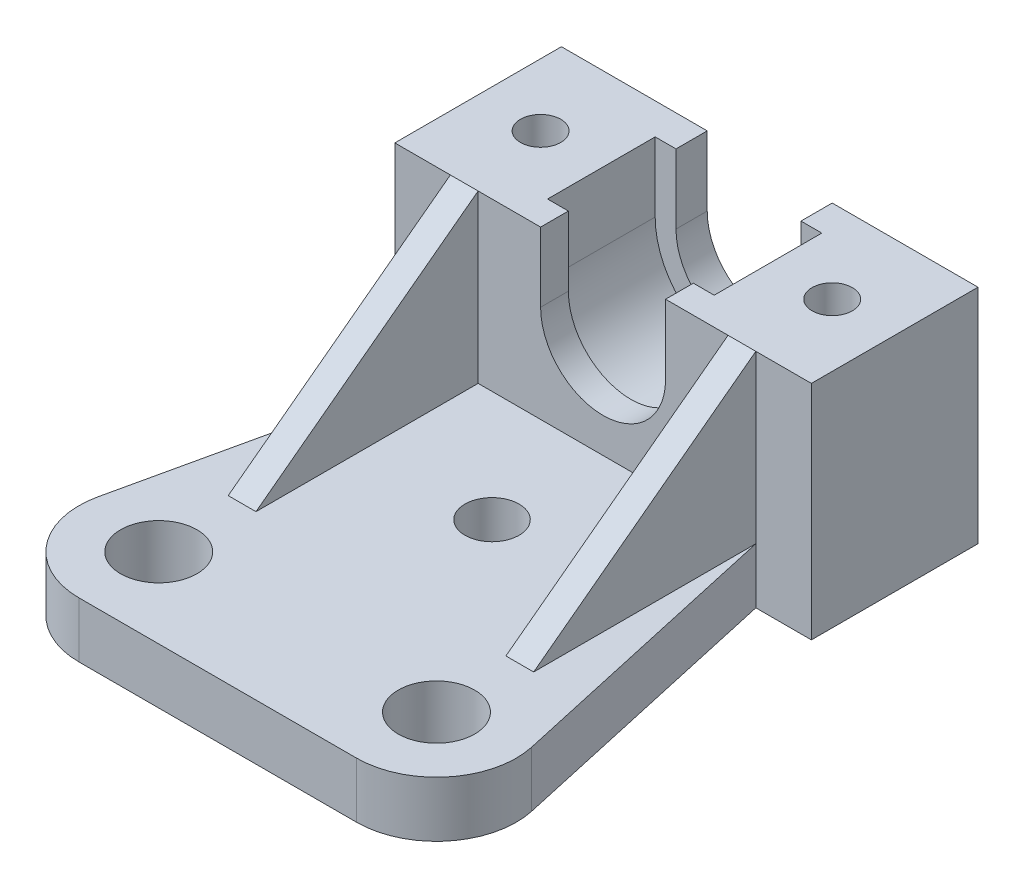
ISO-10303-21;
HEADER;
FILE_DESCRIPTION(('STEP AP214'),'2;1');
FILE_NAME('part.step','',(''),(''),'','','');
FILE_SCHEMA(('AUTOMOTIVE_DESIGN { 1 0 10303 214 1 1 1 1 }'));
ENDSEC;
DATA;
#1=APPLICATION_CONTEXT('core data for automotive mechanical design processes');
#2=APPLICATION_PROTOCOL_DEFINITION('international standard','automotive_design',2000,#1);
#3=PRODUCT_CONTEXT('',#1,'mechanical');
#4=PRODUCT('Part','Part','',(#3));
#5=PRODUCT_RELATED_PRODUCT_CATEGORY('part','',(#4));
#6=PRODUCT_DEFINITION_FORMATION('','',#4);
#7=PRODUCT_DEFINITION_CONTEXT('part definition',#1,'design');
#8=PRODUCT_DEFINITION('design','',#6,#7);
#9=PRODUCT_DEFINITION_SHAPE('','',#8);
#10=(LENGTH_UNIT() NAMED_UNIT(*) SI_UNIT(.MILLI.,.METRE.));
#11=(NAMED_UNIT(*) PLANE_ANGLE_UNIT() SI_UNIT($,.RADIAN.));
#12=(NAMED_UNIT(*) SI_UNIT($,.STERADIAN.) SOLID_ANGLE_UNIT());
#13=UNCERTAINTY_MEASURE_WITH_UNIT(LENGTH_MEASURE(1.E-05),#10,'distance_accuracy_value','');
#14=(GEOMETRIC_REPRESENTATION_CONTEXT(3) GLOBAL_UNCERTAINTY_ASSIGNED_CONTEXT((#13)) GLOBAL_UNIT_ASSIGNED_CONTEXT((#10,
#11,#12)) REPRESENTATION_CONTEXT('',''));
#15=CARTESIAN_POINT('',(0.,0.,0.));
#16=DIRECTION('',(0.,0.,1.));
#17=DIRECTION('',(1.,0.,0.));
#18=AXIS2_PLACEMENT_3D('',#15,#16,#17);
#19=CARTESIAN_POINT('',(9.71941115678533,36.,0.));
#20=DIRECTION('',(0.,0.,1.));
#21=DIRECTION('',(1.,0.,0.));
#22=AXIS2_PLACEMENT_3D('',#19,#20,#21);
#23=PLANE('',#22);
#24=DIRECTION('',(-1.,0.,0.));
#25=VECTOR('',#24,1.);
#26=CARTESIAN_POINT('',(-1.28058884321467,29.,0.));
#27=LINE('',#26,#25);
#28=CARTESIAN_POINT('',(18.7194111567853,29.,0.));
#29=VERTEX_POINT('',#28);
#30=CARTESIAN_POINT('',(0.719411156785328,29.,0.));
#31=VERTEX_POINT('',#30);
#32=EDGE_CURVE('E300',#29,#31,#27,.T.);
#33=ORIENTED_EDGE('',*,*,#32,.F.);
#34=DIRECTION('',(0.,-1.,0.));
#35=VECTOR('',#34,1.);
#36=CARTESIAN_POINT('',(18.7194111567853,41.,0.));
#37=LINE('',#36,#35);
#38=CARTESIAN_POINT('',(18.7194111567853,41.,0.));
#39=VERTEX_POINT('',#38);
#40=EDGE_CURVE('E272',#39,#29,#37,.T.);
#41=ORIENTED_EDGE('',*,*,#40,.F.);
#42=DIRECTION('',(1.,0.,0.));
#43=VECTOR('',#42,1.);
#44=CARTESIAN_POINT('',(14.2194111567853,41.,0.));
#45=LINE('',#44,#43);
#46=CARTESIAN_POINT('',(14.2194111567853,41.,0.));
#47=VERTEX_POINT('',#46);
#48=EDGE_CURVE('E409',#47,#39,#45,.T.);
#49=ORIENTED_EDGE('',*,*,#48,.F.);
#50=DIRECTION('',(0.,1.,0.));
#51=VECTOR('',#50,1.);
#52=CARTESIAN_POINT('',(14.2194111567853,36.,0.));
#53=LINE('',#52,#51);
#54=CARTESIAN_POINT('',(14.2194111567853,36.,0.));
#55=VERTEX_POINT('',#54);
#56=EDGE_CURVE('E410',#55,#47,#53,.T.);
#57=ORIENTED_EDGE('',*,*,#56,.F.);
#58=CARTESIAN_POINT('',(9.71941115678533,36.,0.));
#59=DIRECTION('',(0.,0.,1.));
#60=DIRECTION('',(1.,0.,0.));
#61=AXIS2_PLACEMENT_3D('',#58,#59,#60);
#62=CIRCLE('',#61,4.5);
#63=CARTESIAN_POINT('',(5.21941115678532,36.,0.));
#64=VERTEX_POINT('',#63);
#65=EDGE_CURVE('E554',#64,#55,#62,.T.);
#66=ORIENTED_EDGE('',*,*,#65,.F.);
#67=DIRECTION('',(0.,1.,0.));
#68=VECTOR('',#67,1.);
#69=CARTESIAN_POINT('',(5.21941115678532,36.,0.));
#70=LINE('',#69,#68);
#71=CARTESIAN_POINT('',(5.21941115678533,41.,0.));
#72=VERTEX_POINT('',#71);
#73=EDGE_CURVE('E435',#64,#72,#70,.T.);
#74=ORIENTED_EDGE('',*,*,#73,.T.);
#75=DIRECTION('',(1.,0.,0.));
#76=VECTOR('',#75,1.);
#77=CARTESIAN_POINT('',(-5.28058884321467,41.,0.));
#78=LINE('',#77,#76);
#79=CARTESIAN_POINT('',(0.719411156785328,41.,0.));
#80=VERTEX_POINT('',#79);
#81=EDGE_CURVE('E431',#80,#72,#78,.T.);
#82=ORIENTED_EDGE('',*,*,#81,.F.);
#83=DIRECTION('',(0.,-1.,0.));
#84=VECTOR('',#83,1.);
#85=CARTESIAN_POINT('',(0.719411156785328,41.,0.));
#86=LINE('',#85,#84);
#87=EDGE_CURVE('E285',#80,#31,#86,.T.);
#88=ORIENTED_EDGE('',*,*,#87,.T.);
#89=EDGE_LOOP('',(#33,#41,#49,#57,#66,#74,#82,#88));
#90=FACE_BOUND('',#89,.T.);
#91=ADVANCED_FACE('F33',(#90),#23,.T.);
#92=CARTESIAN_POINT('',(-1.28058884321467,29.,16.));
#93=DIRECTION('',(0.,-1.,0.));
#94=DIRECTION('',(0.,0.,-1.));
#95=AXIS2_PLACEMENT_3D('',#92,#93,#94);
#96=PLANE('',#95);
#97=CARTESIAN_POINT('',(9.71941115678533,29.,8.00000000000001));
#98=DIRECTION('',(0.,-1.,0.));
#99=DIRECTION('',(0.,0.,-1.));
#100=AXIS2_PLACEMENT_3D('',#97,#98,#99);
#101=CIRCLE('',#100,1.95);
#102=CARTESIAN_POINT('',(9.71941115678533,29.,6.05000000000001));
#103=VERTEX_POINT('',#102);
#104=EDGE_CURVE('E294',#103,#103,#101,.T.);
#105=ORIENTED_EDGE('',*,*,#104,.T.);
#106=EDGE_LOOP('',(#105));
#107=FACE_BOUND('',#106,.T.);
#108=DIRECTION('',(0.,0.,1.));
#109=VECTOR('',#108,1.);
#110=CARTESIAN_POINT('',(18.7194111567853,29.,0.));
#111=LINE('',#110,#109);
#112=CARTESIAN_POINT('',(18.7194111567853,29.,16.));
#113=VERTEX_POINT('',#112);
#114=EDGE_CURVE('E266',#29,#113,#111,.T.);
#115=ORIENTED_EDGE('',*,*,#114,.F.);
#116=ORIENTED_EDGE('',*,*,#32,.T.);
#117=DIRECTION('',(0.,0.,1.));
#118=VECTOR('',#117,1.);
#119=CARTESIAN_POINT('',(0.719411156785328,29.,0.));
#120=LINE('',#119,#118);
#121=CARTESIAN_POINT('',(0.719411156785328,29.,16.));
#122=VERTEX_POINT('',#121);
#123=EDGE_CURVE('E280',#31,#122,#120,.T.);
#124=ORIENTED_EDGE('',*,*,#123,.T.);
#125=DIRECTION('',(-1.,0.,0.));
#126=VECTOR('',#125,1.);
#127=CARTESIAN_POINT('',(0.719411156785328,29.,16.));
#128=LINE('',#127,#126);
#129=CARTESIAN_POINT('',(-1.28058884321467,29.,16.));
#130=VERTEX_POINT('',#129);
#131=EDGE_CURVE('E288',#122,#130,#128,.T.);
#132=ORIENTED_EDGE('',*,*,#131,.T.);
#133=DIRECTION('',(0.,0.,1.));
#134=VECTOR('',#133,1.);
#135=CARTESIAN_POINT('',(-1.28058884321467,29.,0.));
#136=LINE('',#135,#134);
#137=CARTESIAN_POINT('',(-1.28058884321467,29.,0.));
#138=VERTEX_POINT('',#137);
#139=EDGE_CURVE('E242',#138,#130,#136,.T.);
#140=ORIENTED_EDGE('',*,*,#139,.F.);
#141=DIRECTION('',(0.216992120209696,0.,-0.976173355386686));
#142=VECTOR('',#141,1.);
#143=CARTESIAN_POINT('',(-1.28058884321467,29.,0.));
#144=LINE('',#143,#142);
#145=CARTESIAN_POINT('',(-5.89358563668812,29.,20.7522953087942));
#146=VERTEX_POINT('',#145);
#147=EDGE_CURVE('E225',#146,#138,#144,.T.);
#148=ORIENTED_EDGE('',*,*,#147,.F.);
#149=CARTESIAN_POINT('',(-0.28058884321467,29.,22.));
#150=DIRECTION('',(0.,-1.,0.));
#151=DIRECTION('',(1.,0.,0.));
#152=AXIS2_PLACEMENT_3D('',#149,#150,#151);
#153=CIRCLE('',#152,5.75);
#154=CARTESIAN_POINT('',(-0.280588843214674,29.,27.75));
#155=VERTEX_POINT('',#154);
#156=EDGE_CURVE('E247',#155,#146,#153,.T.);
#157=ORIENTED_EDGE('',*,*,#156,.F.);
#158=DIRECTION('',(-1.,0.,0.));
#159=VECTOR('',#158,1.);
#160=CARTESIAN_POINT('',(-0.280588843214674,29.,27.75));
#161=LINE('',#160,#159);
#162=CARTESIAN_POINT('',(19.7194111567853,29.,27.75));
#163=VERTEX_POINT('',#162);
#164=EDGE_CURVE('E236',#163,#155,#161,.T.);
#165=ORIENTED_EDGE('',*,*,#164,.F.);
#166=CARTESIAN_POINT('',(19.7194111567853,29.,22.));
#167=DIRECTION('',(0.,-1.,0.));
#168=DIRECTION('',(-1.,0.,0.));
#169=AXIS2_PLACEMENT_3D('',#166,#167,#168);
#170=CIRCLE('',#169,5.75);
#171=CARTESIAN_POINT('',(25.3324079502588,29.,20.7522953087942));
#172=VERTEX_POINT('',#171);
#173=EDGE_CURVE('E217',#172,#163,#170,.T.);
#174=ORIENTED_EDGE('',*,*,#173,.F.);
#175=DIRECTION('',(0.216992120209696,0.,0.976173355386686));
#176=VECTOR('',#175,1.);
#177=CARTESIAN_POINT('',(20.7194111567853,29.,0.));
#178=LINE('',#177,#176);
#179=CARTESIAN_POINT('',(20.7194111567853,29.,0.));
#180=VERTEX_POINT('',#179);
#181=EDGE_CURVE('E233',#180,#172,#178,.T.);
#182=ORIENTED_EDGE('',*,*,#181,.F.);
#183=DIRECTION('',(0.,0.,-1.));
#184=VECTOR('',#183,1.);
#185=CARTESIAN_POINT('',(20.7194111567853,29.,0.));
#186=LINE('',#185,#184);
#187=CARTESIAN_POINT('',(20.7194111567853,29.,16.));
#188=VERTEX_POINT('',#187);
#189=EDGE_CURVE('E58',#188,#180,#186,.T.);
#190=ORIENTED_EDGE('',*,*,#189,.F.);
#191=DIRECTION('',(-1.,0.,0.));
#192=VECTOR('',#191,1.);
#193=CARTESIAN_POINT('',(-1.28058884321467,29.,16.));
#194=LINE('',#193,#192);
#195=EDGE_CURVE('E301',#188,#113,#194,.T.);
#196=ORIENTED_EDGE('',*,*,#195,.T.);
#197=EDGE_LOOP('',(#115,#116,#124,#132,#140,#148,#157,#165,#174,#182,#190,#196));
#198=FACE_BOUND('',#197,.T.);
#199=CARTESIAN_POINT('',(19.7194111567853,29.,22.));
#200=DIRECTION('',(0.,-1.,0.));
#201=DIRECTION('',(1.,0.,0.));
#202=AXIS2_PLACEMENT_3D('',#199,#200,#201);
#203=CIRCLE('',#202,2.75);
#204=CARTESIAN_POINT('',(22.4694111567853,29.,22.));
#205=VERTEX_POINT('',#204);
#206=EDGE_CURVE('E339',#205,#205,#203,.T.);
#207=ORIENTED_EDGE('',*,*,#206,.T.);
#208=EDGE_LOOP('',(#207));
#209=FACE_BOUND('',#208,.T.);
#210=CARTESIAN_POINT('',(-0.28058884321467,29.,22.));
#211=DIRECTION('',(0.,-1.,0.));
#212=DIRECTION('',(1.,0.,0.));
#213=AXIS2_PLACEMENT_3D('',#210,#211,#212);
#214=CIRCLE('',#213,2.75);
#215=CARTESIAN_POINT('',(2.46941115678533,29.,22.));
#216=VERTEX_POINT('',#215);
#217=EDGE_CURVE('E324',#216,#216,#214,.T.);
#218=ORIENTED_EDGE('',*,*,#217,.T.);
#219=EDGE_LOOP('',(#218));
#220=FACE_BOUND('',#219,.T.);
#221=ADVANCED_FACE('F231',(#107,#198,#209,#220),#96,.F.);
#222=DIRECTION('',(0.,-1.,0.));
#223=VECTOR('',#222,1.);
#224=CARTESIAN_POINT('',(-1.28058884321467,25.,0.));
#225=LINE('',#224,#223);
#226=CARTESIAN_POINT('',(-1.28058884321467,41.,0.));
#227=VERTEX_POINT('',#226);
#228=EDGE_CURVE('E306',#227,#138,#225,.T.);
#229=ORIENTED_EDGE('',*,*,#228,.F.);
#230=CARTESIAN_POINT('',(-5.28058884321467,41.,0.));
#231=VERTEX_POINT('',#230);
#232=EDGE_CURVE('E439',#231,#227,#78,.T.);
#233=ORIENTED_EDGE('',*,*,#232,.F.);
#234=DIRECTION('',(0.,1.,0.));
#235=VECTOR('',#234,1.);
#236=CARTESIAN_POINT('',(-5.28058884321467,25.,0.));
#237=LINE('',#236,#235);
#238=CARTESIAN_POINT('',(-5.28058884321467,25.,0.));
#239=VERTEX_POINT('',#238);
#240=EDGE_CURVE('E440',#239,#231,#237,.T.);
#241=ORIENTED_EDGE('',*,*,#240,.F.);
#242=DIRECTION('',(-1.,0.,0.));
#243=VECTOR('',#242,1.);
#244=CARTESIAN_POINT('',(9.71941115678533,25.,0.));
#245=LINE('',#244,#243);
#246=CARTESIAN_POINT('',(-1.28058884321467,25.,0.));
#247=VERTEX_POINT('',#246);
#248=EDGE_CURVE('E314',#247,#239,#245,.T.);
#249=ORIENTED_EDGE('',*,*,#248,.F.);
#250=DIRECTION('',(0.,-1.,0.));
#251=VECTOR('',#250,1.);
#252=CARTESIAN_POINT('',(-1.28058884321467,29.,0.));
#253=LINE('',#252,#251);
#254=EDGE_CURVE('E50',#138,#247,#253,.T.);
#255=ORIENTED_EDGE('',*,*,#254,.F.);
#256=EDGE_LOOP('',(#229,#233,#241,#249,#255));
#257=FACE_BOUND('',#256,.T.);
#258=ADVANCED_FACE('F376',(#257),#23,.T.);
#259=CARTESIAN_POINT('',(9.71941115678533,36.,-12.));
#260=DIRECTION('',(0.,0.,1.));
#261=DIRECTION('',(1.,0.,0.));
#262=AXIS2_PLACEMENT_3D('',#259,#260,#261);
#263=CYLINDRICAL_SURFACE('',#262,4.5);
#264=CARTESIAN_POINT('',(9.71941115678533,36.,-9.75));
#265=DIRECTION('',(0.,0.,1.));
#266=DIRECTION('',(1.,0.,0.));
#267=AXIS2_PLACEMENT_3D('',#264,#265,#266);
#268=CIRCLE('',#267,4.5);
#269=CARTESIAN_POINT('',(14.2194111567853,36.,-9.75));
#270=VERTEX_POINT('',#269);
#271=CARTESIAN_POINT('',(5.21941115678532,36.,-9.75));
#272=VERTEX_POINT('',#271);
#273=EDGE_CURVE('E550',#270,#272,#268,.F.);
#274=ORIENTED_EDGE('',*,*,#273,.F.);
#275=DIRECTION('',(0.,0.,1.));
#276=VECTOR('',#275,1.);
#277=CARTESIAN_POINT('',(14.2194111567853,36.,-12.));
#278=LINE('',#277,#276);
#279=CARTESIAN_POINT('',(14.2194111567853,36.,-12.));
#280=VERTEX_POINT('',#279);
#281=EDGE_CURVE('E497',#280,#270,#278,.T.);
#282=ORIENTED_EDGE('',*,*,#281,.F.);
#283=CARTESIAN_POINT('',(9.71941115678533,36.,-12.));
#284=DIRECTION('',(0.,0.,1.));
#285=DIRECTION('',(1.,0.,0.));
#286=AXIS2_PLACEMENT_3D('',#283,#284,#285);
#287=CIRCLE('',#286,4.5);
#288=CARTESIAN_POINT('',(5.21941115678532,36.,-12.));
#289=VERTEX_POINT('',#288);
#290=EDGE_CURVE('E475',#289,#280,#287,.T.);
#291=ORIENTED_EDGE('',*,*,#290,.F.);
#292=DIRECTION('',(0.,0.,1.));
#293=VECTOR('',#292,1.);
#294=CARTESIAN_POINT('',(5.21941115678532,36.,-12.));
#295=LINE('',#294,#293);
#296=EDGE_CURVE('E476',#289,#272,#295,.T.);
#297=ORIENTED_EDGE('',*,*,#296,.T.);
#298=EDGE_LOOP('',(#274,#282,#291,#297));
#299=FACE_BOUND('',#298,.T.);
#300=ADVANCED_FACE('F387',(#299),#263,.F.);
#301=CARTESIAN_POINT('',(14.2194111567853,36.,-12.));
#302=DIRECTION('',(1.,0.,0.));
#303=DIRECTION('',(0.,0.,-1.));
#304=AXIS2_PLACEMENT_3D('',#301,#302,#303);
#305=PLANE('',#304);
#306=DIRECTION('',(0.,-1.,0.));
#307=VECTOR('',#306,1.);
#308=CARTESIAN_POINT('',(14.2194111567853,36.,-9.75));
#309=LINE('',#308,#307);
#310=CARTESIAN_POINT('',(14.2194111567853,41.,-9.75));
#311=VERTEX_POINT('',#310);
#312=EDGE_CURVE('E552',#311,#270,#309,.T.);
#313=ORIENTED_EDGE('',*,*,#312,.F.);
#314=DIRECTION('',(0.,0.,1.));
#315=VECTOR('',#314,1.);
#316=CARTESIAN_POINT('',(14.2194111567853,41.,-12.));
#317=LINE('',#316,#315);
#318=CARTESIAN_POINT('',(14.2194111567853,41.,-12.));
#319=VERTEX_POINT('',#318);
#320=EDGE_CURVE('E493',#319,#311,#317,.T.);
#321=ORIENTED_EDGE('',*,*,#320,.F.);
#322=DIRECTION('',(0.,1.,0.));
#323=VECTOR('',#322,1.);
#324=CARTESIAN_POINT('',(14.2194111567853,36.,-12.));
#325=LINE('',#324,#323);
#326=EDGE_CURVE('E557',#280,#319,#325,.T.);
#327=ORIENTED_EDGE('',*,*,#326,.F.);
#328=ORIENTED_EDGE('',*,*,#281,.T.);
#329=EDGE_LOOP('',(#313,#321,#327,#328));
#330=FACE_BOUND('',#329,.T.);
#331=ADVANCED_FACE('F584',(#330),#305,.F.);
#332=CARTESIAN_POINT('',(14.2194111567853,41.,-12.));
#333=DIRECTION('',(0.,-1.,0.));
#334=DIRECTION('',(0.,0.,-1.));
#335=AXIS2_PLACEMENT_3D('',#332,#333,#334);
#336=PLANE('',#335);
#337=CARTESIAN_POINT('',(20.2194111567853,41.,-6.));
#338=DIRECTION('',(0.,1.,0.));
#339=DIRECTION('',(0.,0.,1.));
#340=AXIS2_PLACEMENT_3D('',#337,#338,#339);
#341=CIRCLE('',#340,1.45);
#342=CARTESIAN_POINT('',(20.2194111567853,41.,-4.55));
#343=VERTEX_POINT('',#342);
#344=EDGE_CURVE('E503',#343,#343,#341,.T.);
#345=ORIENTED_EDGE('',*,*,#344,.F.);
#346=EDGE_LOOP('',(#345));
#347=FACE_BOUND('',#346,.T.);
#348=DIRECTION('',(-1.,0.,0.));
#349=VECTOR('',#348,1.);
#350=CARTESIAN_POINT('',(3.71941115678532,41.,-9.75));
#351=LINE('',#350,#349);
#352=CARTESIAN_POINT('',(15.7194111567853,41.,-9.75));
#353=VERTEX_POINT('',#352);
#354=EDGE_CURVE('E522',#353,#311,#351,.T.);
#355=ORIENTED_EDGE('',*,*,#354,.F.);
#356=DIRECTION('',(0.,0.,1.));
#357=VECTOR('',#356,1.);
#358=CARTESIAN_POINT('',(15.7194111567853,41.,-9.75));
#359=LINE('',#358,#357);
#360=CARTESIAN_POINT('',(15.7194111567853,41.,-2.));
#361=VERTEX_POINT('',#360);
#362=EDGE_CURVE('E541',#353,#361,#359,.T.);
#363=ORIENTED_EDGE('',*,*,#362,.T.);
#364=DIRECTION('',(-1.,0.,0.));
#365=VECTOR('',#364,1.);
#366=CARTESIAN_POINT('',(3.71941115678532,41.,-2.));
#367=LINE('',#366,#365);
#368=CARTESIAN_POINT('',(14.2194111567853,41.,-2.));
#369=VERTEX_POINT('',#368);
#370=EDGE_CURVE('E531',#361,#369,#367,.T.);
#371=ORIENTED_EDGE('',*,*,#370,.T.);
#372=EDGE_CURVE('E492',#369,#47,#317,.T.);
#373=ORIENTED_EDGE('',*,*,#372,.T.);
#374=ORIENTED_EDGE('',*,*,#48,.T.);
#375=DIRECTION('',(1.,0.,0.));
#376=VECTOR('',#375,1.);
#377=CARTESIAN_POINT('',(18.7194111567853,41.,0.));
#378=LINE('',#377,#376);
#379=CARTESIAN_POINT('',(20.7194111567853,41.,0.));
#380=VERTEX_POINT('',#379);
#381=EDGE_CURVE('E274',#39,#380,#378,.T.);
#382=ORIENTED_EDGE('',*,*,#381,.T.);
#383=CARTESIAN_POINT('',(24.7194111567853,41.,0.));
#384=VERTEX_POINT('',#383);
#385=EDGE_CURVE('E403',#380,#384,#45,.T.);
#386=ORIENTED_EDGE('',*,*,#385,.T.);
#387=DIRECTION('',(0.,0.,1.));
#388=VECTOR('',#387,1.);
#389=CARTESIAN_POINT('',(24.7194111567853,41.,-12.));
#390=LINE('',#389,#388);
#391=CARTESIAN_POINT('',(24.7194111567853,41.,-12.));
#392=VERTEX_POINT('',#391);
#393=EDGE_CURVE('E490',#392,#384,#390,.T.);
#394=ORIENTED_EDGE('',*,*,#393,.F.);
#395=DIRECTION('',(1.,0.,0.));
#396=VECTOR('',#395,1.);
#397=CARTESIAN_POINT('',(14.2194111567853,41.,-12.));
#398=LINE('',#397,#396);
#399=EDGE_CURVE('E559',#319,#392,#398,.T.);
#400=ORIENTED_EDGE('',*,*,#399,.F.);
#401=ORIENTED_EDGE('',*,*,#320,.T.);
#402=EDGE_LOOP('',(#355,#363,#371,#373,#374,#382,#386,#394,#400,#401));
#403=FACE_BOUND('',#402,.T.);
#404=ADVANCED_FACE('F415',(#347,#403),#336,.F.);
#405=CARTESIAN_POINT('',(-5.28058884321467,41.,-12.));
#406=DIRECTION('',(0.,-1.,0.));
#407=DIRECTION('',(0.,0.,-1.));
#408=AXIS2_PLACEMENT_3D('',#405,#406,#407);
#409=PLANE('',#408);
#410=CARTESIAN_POINT('',(-0.780588843214674,41.,-6.));
#411=DIRECTION('',(0.,1.,0.));
#412=DIRECTION('',(0.,0.,-1.));
#413=AXIS2_PLACEMENT_3D('',#410,#411,#412);
#414=CIRCLE('',#413,1.45);
#415=CARTESIAN_POINT('',(-0.780588843214674,41.,-7.45));
#416=VERTEX_POINT('',#415);
#417=EDGE_CURVE('E304',#416,#416,#414,.T.);
#418=ORIENTED_EDGE('',*,*,#417,.F.);
#419=EDGE_LOOP('',(#418));
#420=FACE_BOUND('',#419,.T.);
#421=CARTESIAN_POINT('',(5.21941115678532,41.,-9.75));
#422=VERTEX_POINT('',#421);
#423=CARTESIAN_POINT('',(3.71941115678532,41.,-9.75));
#424=VERTEX_POINT('',#423);
#425=EDGE_CURVE('E521',#422,#424,#351,.T.);
#426=ORIENTED_EDGE('',*,*,#425,.F.);
#427=DIRECTION('',(0.,0.,1.));
#428=VECTOR('',#427,1.);
#429=CARTESIAN_POINT('',(5.21941115678533,41.,-12.));
#430=LINE('',#429,#428);
#431=CARTESIAN_POINT('',(5.21941115678533,41.,-12.));
#432=VERTEX_POINT('',#431);
#433=EDGE_CURVE('E481',#432,#422,#430,.T.);
#434=ORIENTED_EDGE('',*,*,#433,.F.);
#435=DIRECTION('',(1.,0.,0.));
#436=VECTOR('',#435,1.);
#437=CARTESIAN_POINT('',(-5.28058884321467,41.,-12.));
#438=LINE('',#437,#436);
#439=CARTESIAN_POINT('',(-5.28058884321467,41.,-12.));
#440=VERTEX_POINT('',#439);
#441=EDGE_CURVE('E567',#440,#432,#438,.T.);
#442=ORIENTED_EDGE('',*,*,#441,.F.);
#443=DIRECTION('',(0.,0.,1.));
#444=VECTOR('',#443,1.);
#445=CARTESIAN_POINT('',(-5.28058884321467,41.,-12.));
#446=LINE('',#445,#444);
#447=EDGE_CURVE('E484',#440,#231,#446,.T.);
#448=ORIENTED_EDGE('',*,*,#447,.T.);
#449=ORIENTED_EDGE('',*,*,#232,.T.);
#450=DIRECTION('',(-1.,0.,0.));
#451=VECTOR('',#450,1.);
#452=CARTESIAN_POINT('',(0.719411156785328,41.,0.));
#453=LINE('',#452,#451);
#454=EDGE_CURVE('E291',#80,#227,#453,.T.);
#455=ORIENTED_EDGE('',*,*,#454,.F.);
#456=ORIENTED_EDGE('',*,*,#81,.T.);
#457=CARTESIAN_POINT('',(5.21941115678533,41.,-2.));
#458=VERTEX_POINT('',#457);
#459=EDGE_CURVE('E479',#458,#72,#430,.T.);
#460=ORIENTED_EDGE('',*,*,#459,.F.);
#461=CARTESIAN_POINT('',(3.71941115678532,41.,-2.));
#462=VERTEX_POINT('',#461);
#463=EDGE_CURVE('E530',#458,#462,#367,.T.);
#464=ORIENTED_EDGE('',*,*,#463,.T.);
#465=DIRECTION('',(0.,0.,1.));
#466=VECTOR('',#465,1.);
#467=CARTESIAN_POINT('',(3.71941115678532,41.,-9.75));
#468=LINE('',#467,#466);
#469=EDGE_CURVE('E539',#424,#462,#468,.T.);
#470=ORIENTED_EDGE('',*,*,#469,.F.);
#471=EDGE_LOOP('',(#426,#434,#442,#448,#449,#455,#456,#460,#464,#470));
#472=FACE_BOUND('',#471,.T.);
#473=ADVANCED_FACE('F444',(#420,#472),#409,.F.);
#474=CARTESIAN_POINT('',(5.21941115678532,36.,-12.));
#475=DIRECTION('',(1.,0.,0.));
#476=DIRECTION('',(0.,1.,0.));
#477=AXIS2_PLACEMENT_3D('',#474,#475,#476);
#478=PLANE('',#477);
#479=ORIENTED_EDGE('',*,*,#433,.T.);
#480=DIRECTION('',(0.,-1.,0.));
#481=VECTOR('',#480,1.);
#482=CARTESIAN_POINT('',(5.21941115678532,36.,-9.75));
#483=LINE('',#482,#481);
#484=EDGE_CURVE('E11',#422,#272,#483,.T.);
#485=ORIENTED_EDGE('',*,*,#484,.T.);
#486=ORIENTED_EDGE('',*,*,#296,.F.);
#487=DIRECTION('',(0.,1.,0.));
#488=VECTOR('',#487,1.);
#489=CARTESIAN_POINT('',(5.21941115678532,36.,-12.));
#490=LINE('',#489,#488);
#491=EDGE_CURVE('E569',#289,#432,#490,.T.);
#492=ORIENTED_EDGE('',*,*,#491,.T.);
#493=EDGE_LOOP('',(#479,#485,#486,#492));
#494=FACE_BOUND('',#493,.T.);
#495=ADVANCED_FACE('F588',(#494),#478,.T.);
#496=CARTESIAN_POINT('',(14.2194111567853,36.,-2.));
#497=VERTEX_POINT('',#496);
#498=EDGE_CURVE('E496',#497,#55,#278,.T.);
#499=ORIENTED_EDGE('',*,*,#498,.F.);
#500=CARTESIAN_POINT('',(9.71941115678533,36.,-2.));
#501=DIRECTION('',(0.,0.,1.));
#502=DIRECTION('',(1.,0.,0.));
#503=AXIS2_PLACEMENT_3D('',#500,#501,#502);
#504=CIRCLE('',#503,4.5);
#505=CARTESIAN_POINT('',(5.21941115678532,36.,-2.));
#506=VERTEX_POINT('',#505);
#507=EDGE_CURVE('E538',#497,#506,#504,.F.);
#508=ORIENTED_EDGE('',*,*,#507,.T.);
#509=EDGE_CURVE('E480',#506,#64,#295,.T.);
#510=ORIENTED_EDGE('',*,*,#509,.T.);
#511=ORIENTED_EDGE('',*,*,#65,.T.);
#512=EDGE_LOOP('',(#499,#508,#510,#511));
#513=FACE_BOUND('',#512,.T.);
#514=ADVANCED_FACE('F35',(#513),#263,.F.);
#515=ORIENTED_EDGE('',*,*,#372,.F.);
#516=DIRECTION('',(0.,-1.,0.));
#517=VECTOR('',#516,1.);
#518=CARTESIAN_POINT('',(14.2194111567853,36.,-2.));
#519=LINE('',#518,#517);
#520=EDGE_CURVE('E547',#369,#497,#519,.T.);
#521=ORIENTED_EDGE('',*,*,#520,.T.);
#522=ORIENTED_EDGE('',*,*,#498,.T.);
#523=ORIENTED_EDGE('',*,*,#56,.T.);
#524=EDGE_LOOP('',(#515,#521,#522,#523));
#525=FACE_BOUND('',#524,.T.);
#526=ADVANCED_FACE('F772',(#525),#305,.F.);
#527=CARTESIAN_POINT('',(24.7194111567853,41.,-12.));
#528=DIRECTION('',(-1.,0.,0.));
#529=DIRECTION('',(0.,0.,1.));
#530=AXIS2_PLACEMENT_3D('',#527,#528,#529);
#531=PLANE('',#530);
#532=DIRECTION('',(0.,-1.,0.));
#533=VECTOR('',#532,1.);
#534=CARTESIAN_POINT('',(24.7194111567853,41.,0.));
#535=LINE('',#534,#533);
#536=CARTESIAN_POINT('',(24.7194111567853,25.,0.));
#537=VERTEX_POINT('',#536);
#538=EDGE_CURVE('E405',#384,#537,#535,.T.);
#539=ORIENTED_EDGE('',*,*,#538,.T.);
#540=DIRECTION('',(0.,0.,1.));
#541=VECTOR('',#540,1.);
#542=CARTESIAN_POINT('',(24.7194111567853,25.,-12.));
#543=LINE('',#542,#541);
#544=CARTESIAN_POINT('',(24.7194111567853,25.,-12.));
#545=VERTEX_POINT('',#544);
#546=EDGE_CURVE('E465',#545,#537,#543,.T.);
#547=ORIENTED_EDGE('',*,*,#546,.F.);
#548=DIRECTION('',(0.,-1.,0.));
#549=VECTOR('',#548,1.);
#550=CARTESIAN_POINT('',(24.7194111567853,41.,-12.));
#551=LINE('',#550,#549);
#552=EDGE_CURVE('E561',#392,#545,#551,.T.);
#553=ORIENTED_EDGE('',*,*,#552,.F.);
#554=ORIENTED_EDGE('',*,*,#393,.T.);
#555=EDGE_LOOP('',(#539,#547,#553,#554));
#556=FACE_BOUND('',#555,.T.);
#557=ADVANCED_FACE('F360',(#556),#531,.F.);
#558=CARTESIAN_POINT('',(9.71941115678533,25.,-12.));
#559=DIRECTION('',(0.,1.,0.));
#560=DIRECTION('',(-1.,0.,0.));
#561=AXIS2_PLACEMENT_3D('',#558,#559,#560);
#562=PLANE('',#561);
#563=DIRECTION('',(0.216992120209696,0.,-0.976173355386686));
#564=VECTOR('',#563,1.);
#565=CARTESIAN_POINT('',(-1.28058884321467,25.,0.));
#566=LINE('',#565,#564);
#567=CARTESIAN_POINT('',(-5.89358563668812,25.,20.7522953087942));
#568=VERTEX_POINT('',#567);
#569=EDGE_CURVE('E260',#568,#247,#566,.T.);
#570=ORIENTED_EDGE('',*,*,#569,.T.);
#571=ORIENTED_EDGE('',*,*,#248,.T.);
#572=DIRECTION('',(0.,0.,1.));
#573=VECTOR('',#572,1.);
#574=CARTESIAN_POINT('',(-5.28058884321467,25.,-12.));
#575=LINE('',#574,#573);
#576=CARTESIAN_POINT('',(-5.28058884321467,25.,-12.));
#577=VERTEX_POINT('',#576);
#578=EDGE_CURVE('E486',#577,#239,#575,.T.);
#579=ORIENTED_EDGE('',*,*,#578,.F.);
#580=DIRECTION('',(-1.,0.,0.));
#581=VECTOR('',#580,1.);
#582=CARTESIAN_POINT('',(24.7194111567853,25.,-12.));
#583=LINE('',#582,#581);
#584=EDGE_CURVE('E563',#545,#577,#583,.T.);
#585=ORIENTED_EDGE('',*,*,#584,.F.);
#586=ORIENTED_EDGE('',*,*,#546,.T.);
#587=CARTESIAN_POINT('',(20.7194111567853,25.,0.));
#588=VERTEX_POINT('',#587);
#589=EDGE_CURVE('E462',#537,#588,#245,.T.);
#590=ORIENTED_EDGE('',*,*,#589,.T.);
#591=DIRECTION('',(0.216992120209696,0.,0.976173355386686));
#592=VECTOR('',#591,1.);
#593=CARTESIAN_POINT('',(20.7194111567853,25.,0.));
#594=LINE('',#593,#592);
#595=CARTESIAN_POINT('',(25.3324079502588,25.,20.7522953087942));
#596=VERTEX_POINT('',#595);
#597=EDGE_CURVE('E254',#588,#596,#594,.T.);
#598=ORIENTED_EDGE('',*,*,#597,.T.);
#599=CARTESIAN_POINT('',(19.7194111567853,25.,22.));
#600=DIRECTION('',(0.,-1.,0.));
#601=DIRECTION('',(-1.,0.,0.));
#602=AXIS2_PLACEMENT_3D('',#599,#600,#601);
#603=CIRCLE('',#602,5.75);
#604=CARTESIAN_POINT('',(19.7194111567853,25.,27.75));
#605=VERTEX_POINT('',#604);
#606=EDGE_CURVE('E219',#596,#605,#603,.T.);
#607=ORIENTED_EDGE('',*,*,#606,.T.);
#608=DIRECTION('',(-1.,0.,0.));
#609=VECTOR('',#608,1.);
#610=CARTESIAN_POINT('',(-0.280588843214675,25.,27.75));
#611=LINE('',#610,#609);
#612=CARTESIAN_POINT('',(-0.280588843214675,25.,27.75));
#613=VERTEX_POINT('',#612);
#614=EDGE_CURVE('E253',#605,#613,#611,.T.);
#615=ORIENTED_EDGE('',*,*,#614,.T.);
#616=CARTESIAN_POINT('',(-0.280588843214671,25.,22.));
#617=DIRECTION('',(0.,-1.,0.));
#618=DIRECTION('',(1.,0.,0.));
#619=AXIS2_PLACEMENT_3D('',#616,#617,#618);
#620=CIRCLE('',#619,5.75);
#621=EDGE_CURVE('E257',#613,#568,#620,.T.);
#622=ORIENTED_EDGE('',*,*,#621,.T.);
#623=EDGE_LOOP('',(#570,#571,#579,#585,#586,#590,#598,#607,#615,#622));
#624=FACE_BOUND('',#623,.T.);
#625=CARTESIAN_POINT('',(9.71941115678533,25.,8.00000000000001));
#626=DIRECTION('',(0.,1.,0.));
#627=DIRECTION('',(-1.,0.,0.));
#628=AXIS2_PLACEMENT_3D('',#625,#626,#627);
#629=CIRCLE('',#628,1.95);
#630=CARTESIAN_POINT('',(7.76941115678533,25.,8.00000000000001));
#631=VERTEX_POINT('',#630);
#632=EDGE_CURVE('E297',#631,#631,#629,.T.);
#633=ORIENTED_EDGE('',*,*,#632,.T.);
#634=EDGE_LOOP('',(#633));
#635=FACE_BOUND('',#634,.T.);
#636=CARTESIAN_POINT('',(-0.780588843214674,25.,-6.));
#637=DIRECTION('',(0.,1.,0.));
#638=DIRECTION('',(-1.,0.,0.));
#639=AXIS2_PLACEMENT_3D('',#636,#637,#638);
#640=CIRCLE('',#639,1.45);
#641=CARTESIAN_POINT('',(-2.23058884321467,25.,-6.));
#642=VERTEX_POINT('',#641);
#643=EDGE_CURVE('E468',#642,#642,#640,.T.);
#644=ORIENTED_EDGE('',*,*,#643,.T.);
#645=EDGE_LOOP('',(#644));
#646=FACE_BOUND('',#645,.T.);
#647=CARTESIAN_POINT('',(20.2194111567853,25.,-6.));
#648=DIRECTION('',(0.,1.,0.));
#649=DIRECTION('',(-1.,0.,0.));
#650=AXIS2_PLACEMENT_3D('',#647,#648,#649);
#651=CIRCLE('',#650,1.45);
#652=CARTESIAN_POINT('',(18.7694111567853,25.,-6.));
#653=VERTEX_POINT('',#652);
#654=EDGE_CURVE('E500',#653,#653,#651,.T.);
#655=ORIENTED_EDGE('',*,*,#654,.T.);
#656=EDGE_LOOP('',(#655));
#657=FACE_BOUND('',#656,.T.);
#658=CARTESIAN_POINT('',(19.7194111567853,25.,22.));
#659=DIRECTION('',(0.,-1.,0.));
#660=DIRECTION('',(1.,0.,0.));
#661=AXIS2_PLACEMENT_3D('',#658,#659,#660);
#662=CIRCLE('',#661,2.75);
#663=CARTESIAN_POINT('',(22.4694111567853,25.,22.));
#664=VERTEX_POINT('',#663);
#665=EDGE_CURVE('E342',#664,#664,#662,.T.);
#666=ORIENTED_EDGE('',*,*,#665,.F.);
#667=EDGE_LOOP('',(#666));
#668=FACE_BOUND('',#667,.T.);
#669=CARTESIAN_POINT('',(-0.280588843214671,25.,22.));
#670=DIRECTION('',(0.,-1.,0.));
#671=DIRECTION('',(1.,0.,0.));
#672=AXIS2_PLACEMENT_3D('',#669,#670,#671);
#673=CIRCLE('',#672,2.75);
#674=CARTESIAN_POINT('',(2.46941115678533,25.,22.));
#675=VERTEX_POINT('',#674);
#676=EDGE_CURVE('E336',#675,#675,#673,.T.);
#677=ORIENTED_EDGE('',*,*,#676,.F.);
#678=EDGE_LOOP('',(#677));
#679=FACE_BOUND('',#678,.T.);
#680=ADVANCED_FACE('F356',(#624,#635,#646,#657,#668,#679),#562,.F.);
#681=CARTESIAN_POINT('',(-5.28058884321467,25.,-12.));
#682=DIRECTION('',(1.,0.,0.));
#683=DIRECTION('',(0.,0.,-1.));
#684=AXIS2_PLACEMENT_3D('',#681,#682,#683);
#685=PLANE('',#684);
#686=ORIENTED_EDGE('',*,*,#240,.T.);
#687=ORIENTED_EDGE('',*,*,#447,.F.);
#688=DIRECTION('',(0.,1.,0.));
#689=VECTOR('',#688,1.);
#690=CARTESIAN_POINT('',(-5.28058884321467,25.,-12.));
#691=LINE('',#690,#689);
#692=EDGE_CURVE('E565',#577,#440,#691,.T.);
#693=ORIENTED_EDGE('',*,*,#692,.F.);
#694=ORIENTED_EDGE('',*,*,#578,.T.);
#695=EDGE_LOOP('',(#686,#687,#693,#694));
#696=FACE_BOUND('',#695,.T.);
#697=ADVANCED_FACE('F359',(#696),#685,.F.);
#698=DIRECTION('',(0.,-1.,0.));
#699=VECTOR('',#698,1.);
#700=CARTESIAN_POINT('',(5.21941115678532,36.,-2.));
#701=LINE('',#700,#699);
#702=EDGE_CURVE('E42',#458,#506,#701,.T.);
#703=ORIENTED_EDGE('',*,*,#702,.F.);
#704=ORIENTED_EDGE('',*,*,#459,.T.);
#705=ORIENTED_EDGE('',*,*,#73,.F.);
#706=ORIENTED_EDGE('',*,*,#509,.F.);
#707=EDGE_LOOP('',(#703,#704,#705,#706));
#708=FACE_BOUND('',#707,.T.);
#709=ADVANCED_FACE('F399',(#708),#478,.T.);
#710=CARTESIAN_POINT('',(9.71941115678533,36.,-12.));
#711=DIRECTION('',(0.,0.,1.));
#712=DIRECTION('',(1.,0.,0.));
#713=AXIS2_PLACEMENT_3D('',#710,#711,#712);
#714=PLANE('',#713);
#715=ORIENTED_EDGE('',*,*,#290,.T.);
#716=ORIENTED_EDGE('',*,*,#326,.T.);
#717=ORIENTED_EDGE('',*,*,#399,.T.);
#718=ORIENTED_EDGE('',*,*,#552,.T.);
#719=ORIENTED_EDGE('',*,*,#584,.T.);
#720=ORIENTED_EDGE('',*,*,#692,.T.);
#721=ORIENTED_EDGE('',*,*,#441,.T.);
#722=ORIENTED_EDGE('',*,*,#491,.F.);
#723=EDGE_LOOP('',(#715,#716,#717,#718,#719,#720,#721,#722));
#724=FACE_BOUND('',#723,.T.);
#725=ADVANCED_FACE('F390',(#724),#714,.F.);
#726=ORIENTED_EDGE('',*,*,#385,.F.);
#727=DIRECTION('',(0.,1.,0.));
#728=VECTOR('',#727,1.);
#729=CARTESIAN_POINT('',(20.7194111567853,25.,0.));
#730=LINE('',#729,#728);
#731=EDGE_CURVE('E313',#180,#380,#730,.T.);
#732=ORIENTED_EDGE('',*,*,#731,.F.);
#733=EDGE_CURVE('E240',#588,#180,#730,.T.);
#734=ORIENTED_EDGE('',*,*,#733,.F.);
#735=ORIENTED_EDGE('',*,*,#589,.F.);
#736=ORIENTED_EDGE('',*,*,#538,.F.);
#737=EDGE_LOOP('',(#726,#732,#734,#735,#736));
#738=FACE_BOUND('',#737,.T.);
#739=ADVANCED_FACE('F377',(#738),#23,.T.);
#740=CARTESIAN_POINT('',(9.71941115678533,36.,-9.75));
#741=DIRECTION('',(0.,0.,1.));
#742=DIRECTION('',(1.,0.,0.));
#743=AXIS2_PLACEMENT_3D('',#740,#741,#742);
#744=PLANE('',#743);
#745=ORIENTED_EDGE('',*,*,#312,.T.);
#746=ORIENTED_EDGE('',*,*,#273,.T.);
#747=ORIENTED_EDGE('',*,*,#484,.F.);
#748=ORIENTED_EDGE('',*,*,#425,.T.);
#749=DIRECTION('',(0.,-1.,0.));
#750=VECTOR('',#749,1.);
#751=CARTESIAN_POINT('',(3.71941115678532,36.,-9.75));
#752=LINE('',#751,#750);
#753=CARTESIAN_POINT('',(3.71941115678532,36.,-9.75));
#754=VERTEX_POINT('',#753);
#755=EDGE_CURVE('E524',#424,#754,#752,.T.);
#756=ORIENTED_EDGE('',*,*,#755,.T.);
#757=CARTESIAN_POINT('',(9.71941115678533,36.,-9.75));
#758=DIRECTION('',(0.,0.,1.));
#759=DIRECTION('',(1.,0.,0.));
#760=AXIS2_PLACEMENT_3D('',#757,#758,#759);
#761=CIRCLE('',#760,6.);
#762=CARTESIAN_POINT('',(15.7194111567853,36.,-9.75));
#763=VERTEX_POINT('',#762);
#764=EDGE_CURVE('E514',#754,#763,#761,.T.);
#765=ORIENTED_EDGE('',*,*,#764,.T.);
#766=DIRECTION('',(0.,1.,0.));
#767=VECTOR('',#766,1.);
#768=CARTESIAN_POINT('',(15.7194111567853,36.,-9.75));
#769=LINE('',#768,#767);
#770=EDGE_CURVE('E517',#763,#353,#769,.T.);
#771=ORIENTED_EDGE('',*,*,#770,.T.);
#772=ORIENTED_EDGE('',*,*,#354,.T.);
#773=EDGE_LOOP('',(#745,#746,#747,#748,#756,#765,#771,#772));
#774=FACE_BOUND('',#773,.T.);
#775=ADVANCED_FACE('F389',(#774),#744,.T.);
#776=CARTESIAN_POINT('',(9.71941115678533,36.,-2.));
#777=DIRECTION('',(0.,0.,1.));
#778=DIRECTION('',(1.,0.,0.));
#779=AXIS2_PLACEMENT_3D('',#776,#777,#778);
#780=PLANE('',#779);
#781=ORIENTED_EDGE('',*,*,#370,.F.);
#782=DIRECTION('',(0.,1.,0.));
#783=VECTOR('',#782,1.);
#784=CARTESIAN_POINT('',(15.7194111567853,36.,-2.));
#785=LINE('',#784,#783);
#786=CARTESIAN_POINT('',(15.7194111567853,36.,-2.));
#787=VERTEX_POINT('',#786);
#788=EDGE_CURVE('E507',#787,#361,#785,.T.);
#789=ORIENTED_EDGE('',*,*,#788,.F.);
#790=CARTESIAN_POINT('',(9.71941115678533,36.,-2.));
#791=DIRECTION('',(0.,0.,1.));
#792=DIRECTION('',(1.,0.,0.));
#793=AXIS2_PLACEMENT_3D('',#790,#791,#792);
#794=CIRCLE('',#793,6.);
#795=CARTESIAN_POINT('',(3.71941115678532,36.,-2.));
#796=VERTEX_POINT('',#795);
#797=EDGE_CURVE('E502',#796,#787,#794,.T.);
#798=ORIENTED_EDGE('',*,*,#797,.F.);
#799=DIRECTION('',(0.,-1.,0.));
#800=VECTOR('',#799,1.);
#801=CARTESIAN_POINT('',(3.71941115678532,36.,-2.));
#802=LINE('',#801,#800);
#803=EDGE_CURVE('E518',#462,#796,#802,.T.);
#804=ORIENTED_EDGE('',*,*,#803,.F.);
#805=ORIENTED_EDGE('',*,*,#463,.F.);
#806=ORIENTED_EDGE('',*,*,#702,.T.);
#807=ORIENTED_EDGE('',*,*,#507,.F.);
#808=ORIENTED_EDGE('',*,*,#520,.F.);
#809=EDGE_LOOP('',(#781,#789,#798,#804,#805,#806,#807,#808));
#810=FACE_BOUND('',#809,.T.);
#811=ADVANCED_FACE('F396',(#810),#780,.F.);
#812=CARTESIAN_POINT('',(9.71941115678533,36.,-9.75));
#813=DIRECTION('',(0.,0.,1.));
#814=DIRECTION('',(1.,0.,0.));
#815=AXIS2_PLACEMENT_3D('',#812,#813,#814);
#816=CYLINDRICAL_SURFACE('',#815,6.);
#817=ORIENTED_EDGE('',*,*,#797,.T.);
#818=DIRECTION('',(0.,0.,1.));
#819=VECTOR('',#818,1.);
#820=CARTESIAN_POINT('',(15.7194111567853,36.,-9.75));
#821=LINE('',#820,#819);
#822=EDGE_CURVE('E526',#763,#787,#821,.T.);
#823=ORIENTED_EDGE('',*,*,#822,.F.);
#824=ORIENTED_EDGE('',*,*,#764,.F.);
#825=DIRECTION('',(0.,0.,1.));
#826=VECTOR('',#825,1.);
#827=CARTESIAN_POINT('',(3.71941115678532,36.,-9.75));
#828=LINE('',#827,#826);
#829=EDGE_CURVE('E536',#754,#796,#828,.T.);
#830=ORIENTED_EDGE('',*,*,#829,.T.);
#831=EDGE_LOOP('',(#817,#823,#824,#830));
#832=FACE_BOUND('',#831,.T.);
#833=ADVANCED_FACE('F602',(#832),#816,.F.);
#834=CARTESIAN_POINT('',(3.71941115678532,36.,-9.75));
#835=DIRECTION('',(-1.,0.,0.));
#836=DIRECTION('',(0.,0.,1.));
#837=AXIS2_PLACEMENT_3D('',#834,#835,#836);
#838=PLANE('',#837);
#839=ORIENTED_EDGE('',*,*,#803,.T.);
#840=ORIENTED_EDGE('',*,*,#829,.F.);
#841=ORIENTED_EDGE('',*,*,#755,.F.);
#842=ORIENTED_EDGE('',*,*,#469,.T.);
#843=EDGE_LOOP('',(#839,#840,#841,#842));
#844=FACE_BOUND('',#843,.T.);
#845=ADVANCED_FACE('F596',(#844),#838,.F.);
#846=CARTESIAN_POINT('',(15.7194111567853,36.,-9.75));
#847=DIRECTION('',(1.,0.,0.));
#848=DIRECTION('',(0.,0.,-1.));
#849=AXIS2_PLACEMENT_3D('',#846,#847,#848);
#850=PLANE('',#849);
#851=ORIENTED_EDGE('',*,*,#788,.T.);
#852=ORIENTED_EDGE('',*,*,#362,.F.);
#853=ORIENTED_EDGE('',*,*,#770,.F.);
#854=ORIENTED_EDGE('',*,*,#822,.T.);
#855=EDGE_LOOP('',(#851,#852,#853,#854));
#856=FACE_BOUND('',#855,.T.);
#857=ADVANCED_FACE('F607',(#856),#850,.F.);
#858=CARTESIAN_POINT('',(20.2194111567853,23.,-6.));
#859=DIRECTION('',(0.,1.,0.));
#860=DIRECTION('',(0.,0.,1.));
#861=AXIS2_PLACEMENT_3D('',#858,#859,#860);
#862=CYLINDRICAL_SURFACE('',#861,1.45);
#863=ORIENTED_EDGE('',*,*,#344,.T.);
#864=EDGE_LOOP('',(#863));
#865=FACE_BOUND('',#864,.T.);
#866=ORIENTED_EDGE('',*,*,#654,.F.);
#867=EDGE_LOOP('',(#866));
#868=FACE_BOUND('',#867,.T.);
#869=ADVANCED_FACE('F609',(#865,#868),#862,.F.);
#870=CARTESIAN_POINT('',(-0.780588843214674,23.,-6.));
#871=DIRECTION('',(0.,1.,0.));
#872=DIRECTION('',(0.,0.,1.));
#873=AXIS2_PLACEMENT_3D('',#870,#871,#872);
#874=CYLINDRICAL_SURFACE('',#873,1.45);
#875=ORIENTED_EDGE('',*,*,#417,.T.);
#876=EDGE_LOOP('',(#875));
#877=FACE_BOUND('',#876,.T.);
#878=ORIENTED_EDGE('',*,*,#643,.F.);
#879=EDGE_LOOP('',(#878));
#880=FACE_BOUND('',#879,.T.);
#881=ADVANCED_FACE('F615',(#877,#880),#874,.F.);
#882=CARTESIAN_POINT('',(-1.28058884321467,25.,16.));
#883=DIRECTION('',(1.,0.,0.));
#884=DIRECTION('',(0.,0.,-1.));
#885=AXIS2_PLACEMENT_3D('',#882,#883,#884);
#886=PLANE('',#885);
#887=ORIENTED_EDGE('',*,*,#228,.T.);
#888=ORIENTED_EDGE('',*,*,#139,.T.);
#889=DIRECTION('',(0.,0.6,-0.8));
#890=VECTOR('',#889,1.);
#891=CARTESIAN_POINT('',(-1.28058884321467,29.,16.));
#892=LINE('',#891,#890);
#893=EDGE_CURVE('E279',#130,#227,#892,.T.);
#894=ORIENTED_EDGE('',*,*,#893,.T.);
#895=EDGE_LOOP('',(#887,#888,#894));
#896=FACE_BOUND('',#895,.T.);
#897=ADVANCED_FACE('F449',(#896),#886,.F.);
#898=CARTESIAN_POINT('',(20.7194111567853,25.,16.));
#899=DIRECTION('',(-1.,0.,0.));
#900=DIRECTION('',(0.,0.,1.));
#901=AXIS2_PLACEMENT_3D('',#898,#899,#900);
#902=PLANE('',#901);
#903=DIRECTION('',(0.,0.6,-0.8));
#904=VECTOR('',#903,1.);
#905=CARTESIAN_POINT('',(20.7194111567853,29.,16.));
#906=LINE('',#905,#904);
#907=EDGE_CURVE('E270',#188,#380,#906,.T.);
#908=ORIENTED_EDGE('',*,*,#907,.F.);
#909=ORIENTED_EDGE('',*,*,#189,.T.);
#910=ORIENTED_EDGE('',*,*,#731,.T.);
#911=EDGE_LOOP('',(#908,#909,#910));
#912=FACE_BOUND('',#911,.T.);
#913=ADVANCED_FACE('F632',(#912),#902,.F.);
#914=CARTESIAN_POINT('',(9.71941115678533,14.5,8.00000000000001));
#915=DIRECTION('',(0.,1.,0.));
#916=DIRECTION('',(0.,0.,1.));
#917=AXIS2_PLACEMENT_3D('',#914,#915,#916);
#918=CYLINDRICAL_SURFACE('',#917,1.95);
#919=ORIENTED_EDGE('',*,*,#104,.F.);
#920=EDGE_LOOP('',(#919));
#921=FACE_BOUND('',#920,.T.);
#922=ORIENTED_EDGE('',*,*,#632,.F.);
#923=EDGE_LOOP('',(#922));
#924=FACE_BOUND('',#923,.T.);
#925=ADVANCED_FACE('F635',(#921,#924),#918,.F.);
#926=CARTESIAN_POINT('',(0.719411156785328,29.,16.));
#927=DIRECTION('',(0.,0.8,0.6));
#928=DIRECTION('',(0.,-0.6,0.8));
#929=AXIS2_PLACEMENT_3D('',#926,#927,#928);
#930=PLANE('',#929);
#931=ORIENTED_EDGE('',*,*,#893,.F.);
#932=ORIENTED_EDGE('',*,*,#131,.F.);
#933=DIRECTION('',(0.,0.6,-0.8));
#934=VECTOR('',#933,1.);
#935=CARTESIAN_POINT('',(0.719411156785328,29.,16.));
#936=LINE('',#935,#934);
#937=EDGE_CURVE('E283',#122,#80,#936,.T.);
#938=ORIENTED_EDGE('',*,*,#937,.T.);
#939=ORIENTED_EDGE('',*,*,#454,.T.);
#940=EDGE_LOOP('',(#931,#932,#938,#939));
#941=FACE_BOUND('',#940,.T.);
#942=ADVANCED_FACE('F448',(#941),#930,.T.);
#943=CARTESIAN_POINT('',(0.719411156785328,0.,0.));
#944=DIRECTION('',(1.,0.,0.));
#945=DIRECTION('',(0.,0.,-1.));
#946=AXIS2_PLACEMENT_3D('',#943,#944,#945);
#947=PLANE('',#946);
#948=ORIENTED_EDGE('',*,*,#123,.F.);
#949=ORIENTED_EDGE('',*,*,#87,.F.);
#950=ORIENTED_EDGE('',*,*,#937,.F.);
#951=EDGE_LOOP('',(#948,#949,#950));
#952=FACE_BOUND('',#951,.T.);
#953=ADVANCED_FACE('F428',(#952),#947,.T.);
#954=CARTESIAN_POINT('',(18.7194111567853,29.,16.));
#955=DIRECTION('',(0.,-0.8,-0.6));
#956=DIRECTION('',(0.,0.6,-0.8));
#957=AXIS2_PLACEMENT_3D('',#954,#955,#956);
#958=PLANE('',#957);
#959=ORIENTED_EDGE('',*,*,#907,.T.);
#960=ORIENTED_EDGE('',*,*,#381,.F.);
#961=DIRECTION('',(0.,0.6,-0.8));
#962=VECTOR('',#961,1.);
#963=CARTESIAN_POINT('',(18.7194111567853,29.,16.));
#964=LINE('',#963,#962);
#965=EDGE_CURVE('E269',#113,#39,#964,.T.);
#966=ORIENTED_EDGE('',*,*,#965,.F.);
#967=ORIENTED_EDGE('',*,*,#195,.F.);
#968=EDGE_LOOP('',(#959,#960,#966,#967));
#969=FACE_BOUND('',#968,.T.);
#970=ADVANCED_FACE('F419',(#969),#958,.F.);
#971=CARTESIAN_POINT('',(18.7194111567853,0.,0.));
#972=DIRECTION('',(1.,0.,0.));
#973=DIRECTION('',(0.,0.,-1.));
#974=AXIS2_PLACEMENT_3D('',#971,#972,#973);
#975=PLANE('',#974);
#976=ORIENTED_EDGE('',*,*,#114,.T.);
#977=ORIENTED_EDGE('',*,*,#965,.T.);
#978=ORIENTED_EDGE('',*,*,#40,.T.);
#979=EDGE_LOOP('',(#976,#977,#978));
#980=FACE_BOUND('',#979,.T.);
#981=ADVANCED_FACE('F423',(#980),#975,.F.);
#982=CARTESIAN_POINT('',(-1.28058884321467,29.,0.));
#983=DIRECTION('',(-0.976173355386686,0.,-0.216992120209696));
#984=DIRECTION('',(-0.216992120209696,0.,0.976173355386686));
#985=AXIS2_PLACEMENT_3D('',#982,#983,#984);
#986=PLANE('',#985);
#987=ORIENTED_EDGE('',*,*,#569,.F.);
#988=DIRECTION('',(0.,-1.,0.));
#989=VECTOR('',#988,1.);
#990=CARTESIAN_POINT('',(-5.89358563668812,29.,20.7522953087942));
#991=LINE('',#990,#989);
#992=EDGE_CURVE('E261',#146,#568,#991,.T.);
#993=ORIENTED_EDGE('',*,*,#992,.F.);
#994=ORIENTED_EDGE('',*,*,#147,.T.);
#995=ORIENTED_EDGE('',*,*,#254,.T.);
#996=EDGE_LOOP('',(#987,#993,#994,#995));
#997=FACE_BOUND('',#996,.T.);
#998=ADVANCED_FACE('F452',(#997),#986,.T.);
#999=CARTESIAN_POINT('',(-0.28058884321467,29.,22.));
#1000=DIRECTION('',(0.,-1.,0.));
#1001=DIRECTION('',(1.,0.,0.));
#1002=AXIS2_PLACEMENT_3D('',#999,#1000,#1001);
#1003=CYLINDRICAL_SURFACE('',#1002,5.75);
#1004=ORIENTED_EDGE('',*,*,#621,.F.);
#1005=DIRECTION('',(0.,-1.,0.));
#1006=VECTOR('',#1005,1.);
#1007=CARTESIAN_POINT('',(-0.280588843214674,29.,27.75));
#1008=LINE('',#1007,#1006);
#1009=EDGE_CURVE('E263',#155,#613,#1008,.T.);
#1010=ORIENTED_EDGE('',*,*,#1009,.F.);
#1011=ORIENTED_EDGE('',*,*,#156,.T.);
#1012=ORIENTED_EDGE('',*,*,#992,.T.);
#1013=EDGE_LOOP('',(#1004,#1010,#1011,#1012));
#1014=FACE_BOUND('',#1013,.T.);
#1015=ADVANCED_FACE('F455',(#1014),#1003,.T.);
#1016=CARTESIAN_POINT('',(-0.280588843214674,29.,27.75));
#1017=DIRECTION('',(0.,0.,1.));
#1018=DIRECTION('',(1.,0.,0.));
#1019=AXIS2_PLACEMENT_3D('',#1016,#1017,#1018);
#1020=PLANE('',#1019);
#1021=ORIENTED_EDGE('',*,*,#614,.F.);
#1022=DIRECTION('',(0.,-1.,0.));
#1023=VECTOR('',#1022,1.);
#1024=CARTESIAN_POINT('',(19.7194111567853,29.,27.75));
#1025=LINE('',#1024,#1023);
#1026=EDGE_CURVE('E224',#163,#605,#1025,.T.);
#1027=ORIENTED_EDGE('',*,*,#1026,.F.);
#1028=ORIENTED_EDGE('',*,*,#164,.T.);
#1029=ORIENTED_EDGE('',*,*,#1009,.T.);
#1030=EDGE_LOOP('',(#1021,#1027,#1028,#1029));
#1031=FACE_BOUND('',#1030,.T.);
#1032=ADVANCED_FACE('F458',(#1031),#1020,.T.);
#1033=CARTESIAN_POINT('',(19.7194111567853,29.,22.));
#1034=DIRECTION('',(0.,-1.,0.));
#1035=DIRECTION('',(1.,0.,0.));
#1036=AXIS2_PLACEMENT_3D('',#1033,#1034,#1035);
#1037=CYLINDRICAL_SURFACE('',#1036,5.75);
#1038=ORIENTED_EDGE('',*,*,#606,.F.);
#1039=DIRECTION('',(0.,-1.,0.));
#1040=VECTOR('',#1039,1.);
#1041=CARTESIAN_POINT('',(25.3324079502588,29.,20.7522953087942));
#1042=LINE('',#1041,#1040);
#1043=EDGE_CURVE('E214',#172,#596,#1042,.T.);
#1044=ORIENTED_EDGE('',*,*,#1043,.F.);
#1045=ORIENTED_EDGE('',*,*,#173,.T.);
#1046=ORIENTED_EDGE('',*,*,#1026,.T.);
#1047=EDGE_LOOP('',(#1038,#1044,#1045,#1046));
#1048=FACE_BOUND('',#1047,.T.);
#1049=ADVANCED_FACE('F216',(#1048),#1037,.T.);
#1050=CARTESIAN_POINT('',(20.7194111567853,29.,0.));
#1051=DIRECTION('',(0.976173355386686,0.,-0.216992120209696));
#1052=DIRECTION('',(-0.216992120209696,0.,-0.976173355386686));
#1053=AXIS2_PLACEMENT_3D('',#1050,#1051,#1052);
#1054=PLANE('',#1053);
#1055=ORIENTED_EDGE('',*,*,#597,.F.);
#1056=ORIENTED_EDGE('',*,*,#733,.T.);
#1057=ORIENTED_EDGE('',*,*,#181,.T.);
#1058=ORIENTED_EDGE('',*,*,#1043,.T.);
#1059=EDGE_LOOP('',(#1055,#1056,#1057,#1058));
#1060=FACE_BOUND('',#1059,.T.);
#1061=ADVANCED_FACE('F239',(#1060),#1054,.T.);
#1062=CARTESIAN_POINT('',(-0.28058884321467,29.,22.));
#1063=DIRECTION('',(0.,-1.,0.));
#1064=DIRECTION('',(1.,0.,0.));
#1065=AXIS2_PLACEMENT_3D('',#1062,#1063,#1064);
#1066=CYLINDRICAL_SURFACE('',#1065,2.75);
#1067=ORIENTED_EDGE('',*,*,#217,.F.);
#1068=EDGE_LOOP('',(#1067));
#1069=FACE_BOUND('',#1068,.T.);
#1070=ORIENTED_EDGE('',*,*,#676,.T.);
#1071=EDGE_LOOP('',(#1070));
#1072=FACE_BOUND('',#1071,.T.);
#1073=ADVANCED_FACE('F352',(#1069,#1072),#1066,.F.);
#1074=CARTESIAN_POINT('',(19.7194111567853,29.,22.));
#1075=DIRECTION('',(0.,-1.,0.));
#1076=DIRECTION('',(1.,0.,0.));
#1077=AXIS2_PLACEMENT_3D('',#1074,#1075,#1076);
#1078=CYLINDRICAL_SURFACE('',#1077,2.75);
#1079=ORIENTED_EDGE('',*,*,#206,.F.);
#1080=EDGE_LOOP('',(#1079));
#1081=FACE_BOUND('',#1080,.T.);
#1082=ORIENTED_EDGE('',*,*,#665,.T.);
#1083=EDGE_LOOP('',(#1082));
#1084=FACE_BOUND('',#1083,.T.);
#1085=ADVANCED_FACE('F349',(#1081,#1084),#1078,.F.);
#1086=CLOSED_SHELL('',(#91,#221,#258,#300,#331,#404,#473,#495,#514,#526,#557,#680,#697,#709,
#725,#739,#775,#811,#833,#845,#857,#869,#881,#897,#913,#925,#942,#953,#970,#981,#998,#1015,
#1032,#1049,#1061,#1073,#1085));
#1087=MANIFOLD_SOLID_BREP('B2',#1086);
#1088=ADVANCED_BREP_SHAPE_REPRESENTATION('',(#18,#1087),#14);
#1089=SHAPE_DEFINITION_REPRESENTATION(#9,#1088);
ENDSEC;
END-ISO-10303-21;
